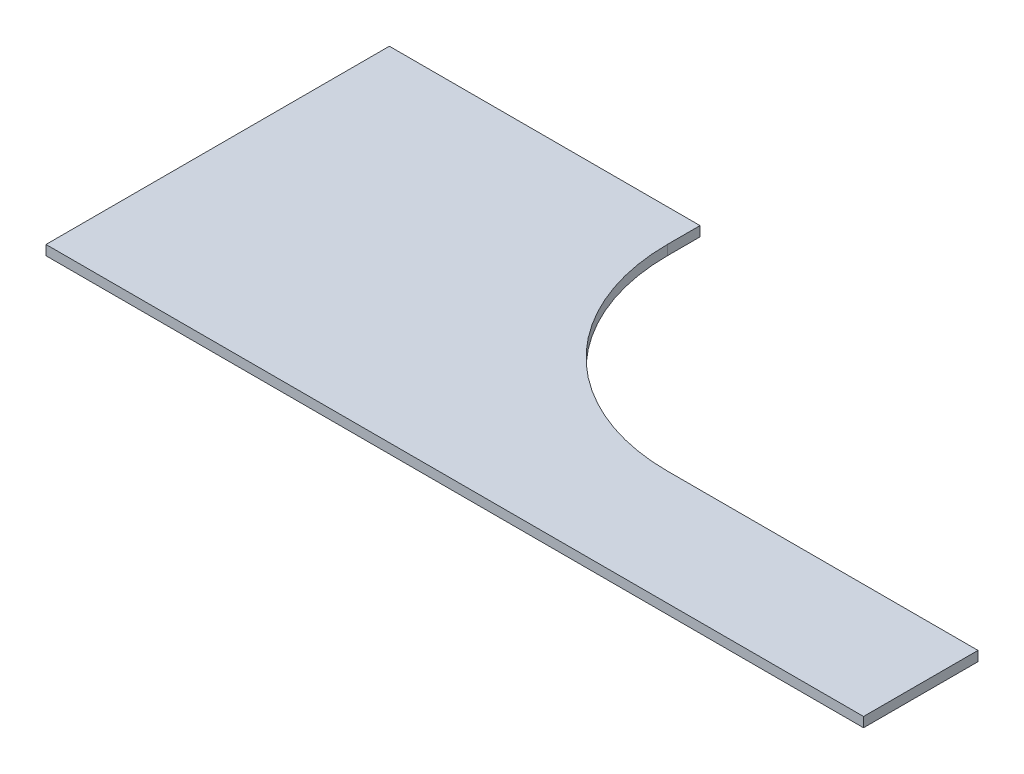
ISO-10303-21;
HEADER;
FILE_DESCRIPTION(('STEP AP214'),'2;1');
FILE_NAME('part.step','',(''),(''),'','','');
FILE_SCHEMA(('AUTOMOTIVE_DESIGN { 1 0 10303 214 1 1 1 1 }'));
ENDSEC;
DATA;
#1=APPLICATION_CONTEXT('core data for automotive mechanical design processes');
#2=APPLICATION_PROTOCOL_DEFINITION('international standard','automotive_design',2000,#1);
#3=PRODUCT_CONTEXT('',#1,'mechanical');
#4=PRODUCT('Part','Part','',(#3));
#5=PRODUCT_RELATED_PRODUCT_CATEGORY('part','',(#4));
#6=PRODUCT_DEFINITION_FORMATION('','',#4);
#7=PRODUCT_DEFINITION_CONTEXT('part definition',#1,'design');
#8=PRODUCT_DEFINITION('design','',#6,#7);
#9=PRODUCT_DEFINITION_SHAPE('','',#8);
#10=(LENGTH_UNIT() NAMED_UNIT(*) SI_UNIT(.MILLI.,.METRE.));
#11=(NAMED_UNIT(*) PLANE_ANGLE_UNIT() SI_UNIT($,.RADIAN.));
#12=(NAMED_UNIT(*) SI_UNIT($,.STERADIAN.) SOLID_ANGLE_UNIT());
#13=UNCERTAINTY_MEASURE_WITH_UNIT(LENGTH_MEASURE(1.E-05),#10,'distance_accuracy_value','');
#14=(GEOMETRIC_REPRESENTATION_CONTEXT(3) GLOBAL_UNCERTAINTY_ASSIGNED_CONTEXT((#13)) GLOBAL_UNIT_ASSIGNED_CONTEXT((#10,
#11,#12)) REPRESENTATION_CONTEXT('',''));
#15=CARTESIAN_POINT('',(0.,0.,0.));
#16=DIRECTION('',(0.,0.,1.));
#17=DIRECTION('',(1.,0.,0.));
#18=AXIS2_PLACEMENT_3D('',#15,#16,#17);
#19=CARTESIAN_POINT('',(78.6699389055989,-5.25,-42.7818403493442));
#20=DIRECTION('',(0.,1.,0.));
#21=DIRECTION('',(0.,0.,1.));
#22=AXIS2_PLACEMENT_3D('',#19,#20,#21);
#23=CYLINDRICAL_SURFACE('',#22,90.);
#24=CARTESIAN_POINT('',(78.6699389055989,-0.75,-42.7818403493442));
#25=DIRECTION('',(0.,-1.,0.));
#26=DIRECTION('',(0.,0.,-1.));
#27=AXIS2_PLACEMENT_3D('',#24,#25,#26);
#28=CIRCLE('',#27,90.);
#29=CARTESIAN_POINT('',(78.6699389055989,-0.75,47.2181596506558));
#30=VERTEX_POINT('',#29);
#31=CARTESIAN_POINT('',(-11.3300610944011,-0.75,-42.7818403493442));
#32=VERTEX_POINT('',#31);
#33=EDGE_CURVE('E126',#30,#32,#28,.T.);
#34=ORIENTED_EDGE('',*,*,#33,.F.);
#35=DIRECTION('',(0.,1.,0.));
#36=VECTOR('',#35,1.);
#37=CARTESIAN_POINT('',(78.6699389055989,-5.25,47.2181596506558));
#38=LINE('',#37,#36);
#39=CARTESIAN_POINT('',(78.6699389055989,-5.25,47.2181596506558));
#40=VERTEX_POINT('',#39);
#41=EDGE_CURVE('E11',#40,#30,#38,.T.);
#42=ORIENTED_EDGE('',*,*,#41,.F.);
#43=CARTESIAN_POINT('',(78.6699389055989,-5.25,-42.7818403493442));
#44=DIRECTION('',(0.,-1.,0.));
#45=DIRECTION('',(0.,0.,-1.));
#46=AXIS2_PLACEMENT_3D('',#43,#44,#45);
#47=CIRCLE('',#46,90.);
#48=CARTESIAN_POINT('',(-11.3300610944011,-5.25,-42.7818403493442));
#49=VERTEX_POINT('',#48);
#50=EDGE_CURVE('E143',#40,#49,#47,.T.);
#51=ORIENTED_EDGE('',*,*,#50,.T.);
#52=DIRECTION('',(0.,1.,0.));
#53=VECTOR('',#52,1.);
#54=CARTESIAN_POINT('',(-11.3300610944011,-5.25,-42.7818403493442));
#55=LINE('',#54,#53);
#56=EDGE_CURVE('E38',#49,#32,#55,.T.);
#57=ORIENTED_EDGE('',*,*,#56,.T.);
#58=EDGE_LOOP('',(#34,#42,#51,#57));
#59=FACE_BOUND('',#58,.T.);
#60=ADVANCED_FACE('F35',(#59),#23,.F.);
#61=CARTESIAN_POINT('',(221.169938905599,-5.25,47.2181596506558));
#62=DIRECTION('',(0.,0.,-1.));
#63=DIRECTION('',(-1.,0.,0.));
#64=AXIS2_PLACEMENT_3D('',#61,#62,#63);
#65=PLANE('',#64);
#66=DIRECTION('',(-1.,0.,0.));
#67=VECTOR('',#66,1.);
#68=CARTESIAN_POINT('',(221.169938905599,-0.75,47.2181596506558));
#69=LINE('',#68,#67);
#70=CARTESIAN_POINT('',(221.169938905599,-0.75,47.2181596506558));
#71=VERTEX_POINT('',#70);
#72=EDGE_CURVE('E141',#71,#30,#69,.T.);
#73=ORIENTED_EDGE('',*,*,#72,.F.);
#74=DIRECTION('',(0.,1.,0.));
#75=VECTOR('',#74,1.);
#76=CARTESIAN_POINT('',(221.169938905599,-5.25,47.2181596506558));
#77=LINE('',#76,#75);
#78=CARTESIAN_POINT('',(221.169938905599,-5.25,47.2181596506558));
#79=VERTEX_POINT('',#78);
#80=EDGE_CURVE('E44',#79,#71,#77,.T.);
#81=ORIENTED_EDGE('',*,*,#80,.F.);
#82=DIRECTION('',(-1.,0.,0.));
#83=VECTOR('',#82,1.);
#84=CARTESIAN_POINT('',(221.169938905599,-5.25,47.2181596506558));
#85=LINE('',#84,#83);
#86=EDGE_CURVE('E116',#79,#40,#85,.T.);
#87=ORIENTED_EDGE('',*,*,#86,.T.);
#88=ORIENTED_EDGE('',*,*,#41,.T.);
#89=EDGE_LOOP('',(#73,#81,#87,#88));
#90=FACE_BOUND('',#89,.T.);
#91=ADVANCED_FACE('F153',(#90),#65,.T.);
#92=CARTESIAN_POINT('',(221.169938905599,-5.25,99.7181596506558));
#93=DIRECTION('',(1.,0.,0.));
#94=DIRECTION('',(0.,0.,-1.));
#95=AXIS2_PLACEMENT_3D('',#92,#93,#94);
#96=PLANE('',#95);
#97=DIRECTION('',(0.,0.,-1.));
#98=VECTOR('',#97,1.);
#99=CARTESIAN_POINT('',(221.169938905599,-0.75,99.7181596506558));
#100=LINE('',#99,#98);
#101=CARTESIAN_POINT('',(221.169938905599,-0.75,99.7181596506558));
#102=VERTEX_POINT('',#101);
#103=EDGE_CURVE('E103',#102,#71,#100,.T.);
#104=ORIENTED_EDGE('',*,*,#103,.F.);
#105=DIRECTION('',(0.,1.,0.));
#106=VECTOR('',#105,1.);
#107=CARTESIAN_POINT('',(221.169938905599,-5.25,99.7181596506558));
#108=LINE('',#107,#106);
#109=CARTESIAN_POINT('',(221.169938905599,-5.25,99.7181596506558));
#110=VERTEX_POINT('',#109);
#111=EDGE_CURVE('E98',#110,#102,#108,.T.);
#112=ORIENTED_EDGE('',*,*,#111,.F.);
#113=DIRECTION('',(0.,0.,-1.));
#114=VECTOR('',#113,1.);
#115=CARTESIAN_POINT('',(221.169938905599,-5.25,99.7181596506558));
#116=LINE('',#115,#114);
#117=EDGE_CURVE('E101',#110,#79,#116,.T.);
#118=ORIENTED_EDGE('',*,*,#117,.T.);
#119=ORIENTED_EDGE('',*,*,#80,.T.);
#120=EDGE_LOOP('',(#104,#112,#118,#119));
#121=FACE_BOUND('',#120,.T.);
#122=ADVANCED_FACE('F100',(#121),#96,.T.);
#123=CARTESIAN_POINT('',(-153.830061094401,-5.25,99.7181596506558));
#124=DIRECTION('',(0.,0.,1.));
#125=DIRECTION('',(1.,0.,0.));
#126=AXIS2_PLACEMENT_3D('',#123,#124,#125);
#127=PLANE('',#126);
#128=DIRECTION('',(1.,0.,0.));
#129=VECTOR('',#128,1.);
#130=CARTESIAN_POINT('',(-153.830061094401,-0.75,99.7181596506558));
#131=LINE('',#130,#129);
#132=CARTESIAN_POINT('',(-153.830061094401,-0.75,99.7181596506558));
#133=VERTEX_POINT('',#132);
#134=EDGE_CURVE('E138',#133,#102,#131,.T.);
#135=ORIENTED_EDGE('',*,*,#134,.F.);
#136=DIRECTION('',(0.,1.,0.));
#137=VECTOR('',#136,1.);
#138=CARTESIAN_POINT('',(-153.830061094401,-5.25,99.7181596506558));
#139=LINE('',#138,#137);
#140=CARTESIAN_POINT('',(-153.830061094401,-5.25,99.7181596506558));
#141=VERTEX_POINT('',#140);
#142=EDGE_CURVE('E108',#141,#133,#139,.T.);
#143=ORIENTED_EDGE('',*,*,#142,.F.);
#144=DIRECTION('',(1.,0.,0.));
#145=VECTOR('',#144,1.);
#146=CARTESIAN_POINT('',(-153.830061094401,-5.25,99.7181596506558));
#147=LINE('',#146,#145);
#148=EDGE_CURVE('E114',#141,#110,#147,.T.);
#149=ORIENTED_EDGE('',*,*,#148,.T.);
#150=ORIENTED_EDGE('',*,*,#111,.T.);
#151=EDGE_LOOP('',(#135,#143,#149,#150));
#152=FACE_BOUND('',#151,.T.);
#153=ADVANCED_FACE('F118',(#152),#127,.T.);
#154=CARTESIAN_POINT('',(-153.830061094401,-5.25,-57.7818403493442));
#155=DIRECTION('',(-1.,0.,0.));
#156=DIRECTION('',(0.,0.,1.));
#157=AXIS2_PLACEMENT_3D('',#154,#155,#156);
#158=PLANE('',#157);
#159=DIRECTION('',(0.,0.,1.));
#160=VECTOR('',#159,1.);
#161=CARTESIAN_POINT('',(-153.830061094401,-0.75,-57.7818403493442));
#162=LINE('',#161,#160);
#163=CARTESIAN_POINT('',(-153.830061094401,-0.75,-57.7818403493442));
#164=VERTEX_POINT('',#163);
#165=EDGE_CURVE('E135',#164,#133,#162,.T.);
#166=ORIENTED_EDGE('',*,*,#165,.F.);
#167=DIRECTION('',(0.,1.,0.));
#168=VECTOR('',#167,1.);
#169=CARTESIAN_POINT('',(-153.830061094401,-5.25,-57.7818403493442));
#170=LINE('',#169,#168);
#171=CARTESIAN_POINT('',(-153.830061094401,-5.25,-57.7818403493442));
#172=VERTEX_POINT('',#171);
#173=EDGE_CURVE('E147',#172,#164,#170,.T.);
#174=ORIENTED_EDGE('',*,*,#173,.F.);
#175=DIRECTION('',(0.,0.,1.));
#176=VECTOR('',#175,1.);
#177=CARTESIAN_POINT('',(-153.830061094401,-5.25,-57.7818403493442));
#178=LINE('',#177,#176);
#179=EDGE_CURVE('E119',#172,#141,#178,.T.);
#180=ORIENTED_EDGE('',*,*,#179,.T.);
#181=ORIENTED_EDGE('',*,*,#142,.T.);
#182=EDGE_LOOP('',(#166,#174,#180,#181));
#183=FACE_BOUND('',#182,.T.);
#184=ADVANCED_FACE('F166',(#183),#158,.T.);
#185=CARTESIAN_POINT('',(-11.3300610944011,-5.25,-57.7818403493442));
#186=DIRECTION('',(0.,0.,-1.));
#187=DIRECTION('',(-1.,0.,0.));
#188=AXIS2_PLACEMENT_3D('',#185,#186,#187);
#189=PLANE('',#188);
#190=DIRECTION('',(-1.,0.,0.));
#191=VECTOR('',#190,1.);
#192=CARTESIAN_POINT('',(-11.3300610944011,-0.75,-57.7818403493442));
#193=LINE('',#192,#191);
#194=CARTESIAN_POINT('',(-11.3300610944011,-0.75,-57.7818403493442));
#195=VERTEX_POINT('',#194);
#196=EDGE_CURVE('E132',#195,#164,#193,.T.);
#197=ORIENTED_EDGE('',*,*,#196,.F.);
#198=DIRECTION('',(0.,1.,0.));
#199=VECTOR('',#198,1.);
#200=CARTESIAN_POINT('',(-11.3300610944011,-5.25,-57.7818403493442));
#201=LINE('',#200,#199);
#202=CARTESIAN_POINT('',(-11.3300610944011,-5.25,-57.7818403493442));
#203=VERTEX_POINT('',#202);
#204=EDGE_CURVE('E148',#203,#195,#201,.T.);
#205=ORIENTED_EDGE('',*,*,#204,.F.);
#206=DIRECTION('',(-1.,0.,0.));
#207=VECTOR('',#206,1.);
#208=CARTESIAN_POINT('',(-11.3300610944011,-5.25,-57.7818403493442));
#209=LINE('',#208,#207);
#210=EDGE_CURVE('E121',#203,#172,#209,.T.);
#211=ORIENTED_EDGE('',*,*,#210,.T.);
#212=ORIENTED_EDGE('',*,*,#173,.T.);
#213=EDGE_LOOP('',(#197,#205,#211,#212));
#214=FACE_BOUND('',#213,.T.);
#215=ADVANCED_FACE('F169',(#214),#189,.T.);
#216=CARTESIAN_POINT('',(-11.3300610944011,-5.25,-42.7818403493442));
#217=DIRECTION('',(1.,0.,0.));
#218=DIRECTION('',(0.,0.,-1.));
#219=AXIS2_PLACEMENT_3D('',#216,#217,#218);
#220=PLANE('',#219);
#221=DIRECTION('',(0.,0.,-1.));
#222=VECTOR('',#221,1.);
#223=CARTESIAN_POINT('',(-11.3300610944011,-0.75,-42.7818403493442));
#224=LINE('',#223,#222);
#225=EDGE_CURVE('E129',#32,#195,#224,.T.);
#226=ORIENTED_EDGE('',*,*,#225,.F.);
#227=ORIENTED_EDGE('',*,*,#56,.F.);
#228=DIRECTION('',(0.,0.,-1.));
#229=VECTOR('',#228,1.);
#230=CARTESIAN_POINT('',(-11.3300610944011,-5.25,-42.7818403493442));
#231=LINE('',#230,#229);
#232=EDGE_CURVE('E231',#49,#203,#231,.T.);
#233=ORIENTED_EDGE('',*,*,#232,.T.);
#234=ORIENTED_EDGE('',*,*,#204,.T.);
#235=EDGE_LOOP('',(#226,#227,#233,#234));
#236=FACE_BOUND('',#235,.T.);
#237=ADVANCED_FACE('F150',(#236),#220,.T.);
#238=CARTESIAN_POINT('',(78.6699389055989,-5.25,-42.7818403493442));
#239=DIRECTION('',(0.,-1.,0.));
#240=DIRECTION('',(0.,0.,-1.));
#241=AXIS2_PLACEMENT_3D('',#238,#239,#240);
#242=PLANE('',#241);
#243=ORIENTED_EDGE('',*,*,#50,.F.);
#244=ORIENTED_EDGE('',*,*,#86,.F.);
#245=ORIENTED_EDGE('',*,*,#117,.F.);
#246=ORIENTED_EDGE('',*,*,#148,.F.);
#247=ORIENTED_EDGE('',*,*,#179,.F.);
#248=ORIENTED_EDGE('',*,*,#210,.F.);
#249=ORIENTED_EDGE('',*,*,#232,.F.);
#250=EDGE_LOOP('',(#243,#244,#245,#246,#247,#248,#249));
#251=FACE_BOUND('',#250,.T.);
#252=ADVANCED_FACE('F112',(#251),#242,.T.);
#253=CARTESIAN_POINT('',(78.6699389055989,-0.75,-42.7818403493442));
#254=DIRECTION('',(0.,-1.,0.));
#255=DIRECTION('',(0.,0.,-1.));
#256=AXIS2_PLACEMENT_3D('',#253,#254,#255);
#257=PLANE('',#256);
#258=ORIENTED_EDGE('',*,*,#33,.T.);
#259=ORIENTED_EDGE('',*,*,#225,.T.);
#260=ORIENTED_EDGE('',*,*,#196,.T.);
#261=ORIENTED_EDGE('',*,*,#165,.T.);
#262=ORIENTED_EDGE('',*,*,#134,.T.);
#263=ORIENTED_EDGE('',*,*,#103,.T.);
#264=ORIENTED_EDGE('',*,*,#72,.T.);
#265=EDGE_LOOP('',(#258,#259,#260,#261,#262,#263,#264));
#266=FACE_BOUND('',#265,.T.);
#267=ADVANCED_FACE('F152',(#266),#257,.F.);
#268=CLOSED_SHELL('',(#60,#91,#122,#153,#184,#215,#237,#252,#267));
#269=MANIFOLD_SOLID_BREP('B2',#268);
#270=ADVANCED_BREP_SHAPE_REPRESENTATION('',(#18,#269),#14);
#271=SHAPE_DEFINITION_REPRESENTATION(#9,#270);
ENDSEC;
END-ISO-10303-21;
